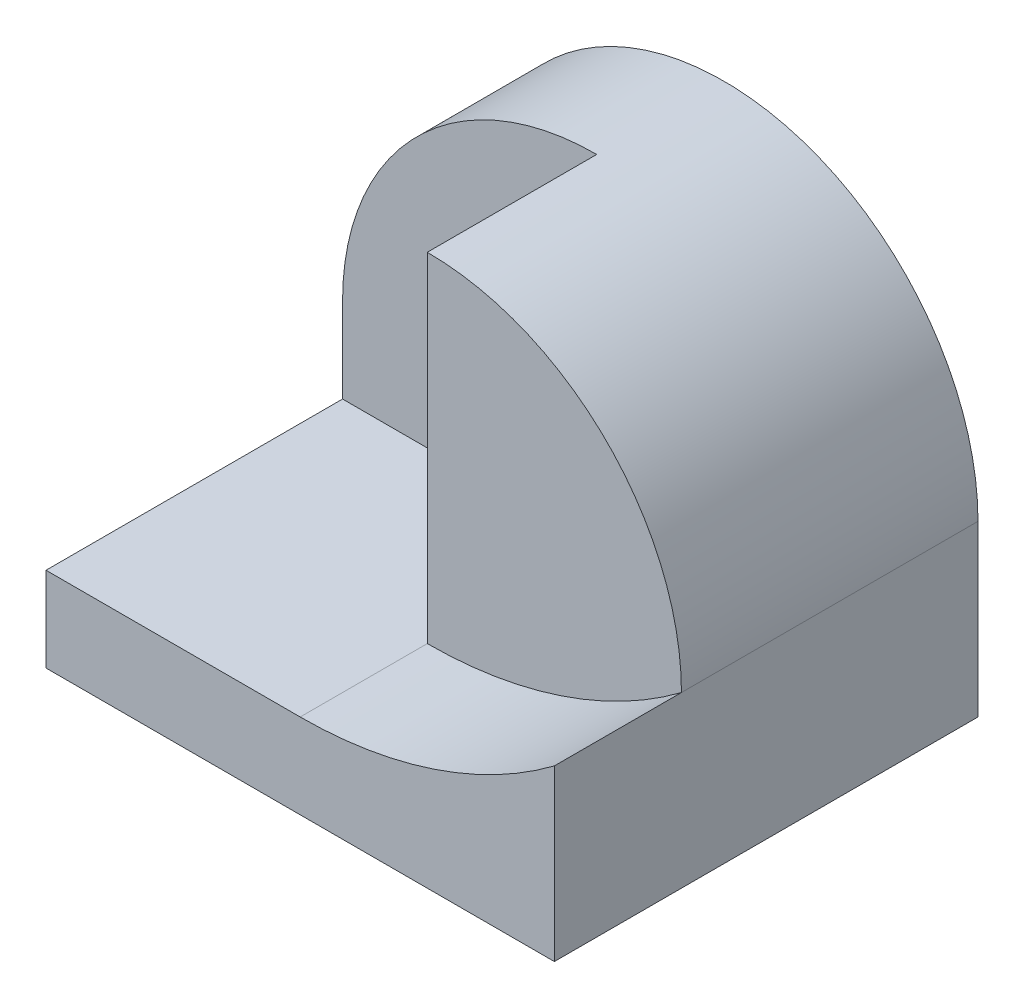
ISO-10303-21;
HEADER;
FILE_DESCRIPTION(('STEP AP214'),'2;1');
FILE_NAME('part.step','',(''),(''),'','','');
FILE_SCHEMA(('AUTOMOTIVE_DESIGN { 1 0 10303 214 1 1 1 1 }'));
ENDSEC;
DATA;
#1=APPLICATION_CONTEXT('core data for automotive mechanical design processes');
#2=APPLICATION_PROTOCOL_DEFINITION('international standard','automotive_design',2000,#1);
#3=PRODUCT_CONTEXT('',#1,'mechanical');
#4=PRODUCT('Part','Part','',(#3));
#5=PRODUCT_RELATED_PRODUCT_CATEGORY('part','',(#4));
#6=PRODUCT_DEFINITION_FORMATION('','',#4);
#7=PRODUCT_DEFINITION_CONTEXT('part definition',#1,'design');
#8=PRODUCT_DEFINITION('design','',#6,#7);
#9=PRODUCT_DEFINITION_SHAPE('','',#8);
#10=(LENGTH_UNIT() NAMED_UNIT(*) SI_UNIT(.MILLI.,.METRE.));
#11=(NAMED_UNIT(*) PLANE_ANGLE_UNIT() SI_UNIT($,.RADIAN.));
#12=(NAMED_UNIT(*) SI_UNIT($,.STERADIAN.) SOLID_ANGLE_UNIT());
#13=UNCERTAINTY_MEASURE_WITH_UNIT(LENGTH_MEASURE(1.E-05),#10,'distance_accuracy_value','');
#14=(GEOMETRIC_REPRESENTATION_CONTEXT(3) GLOBAL_UNCERTAINTY_ASSIGNED_CONTEXT((#13)) GLOBAL_UNIT_ASSIGNED_CONTEXT((#10,
#11,#12)) REPRESENTATION_CONTEXT('',''));
#15=CARTESIAN_POINT('',(0.,0.,0.));
#16=DIRECTION('',(0.,0.,1.));
#17=DIRECTION('',(1.,0.,0.));
#18=AXIS2_PLACEMENT_3D('',#15,#16,#17);
#19=CARTESIAN_POINT('',(30.,20.,15.));
#20=DIRECTION('',(0.,0.,-1.));
#21=DIRECTION('',(-1.,0.,0.));
#22=AXIS2_PLACEMENT_3D('',#19,#20,#21);
#23=CYLINDRICAL_SURFACE('',#22,30.);
#24=CARTESIAN_POINT('',(30.,20.,0.));
#25=DIRECTION('',(0.,0.,-1.));
#26=DIRECTION('',(-1.,0.,0.));
#27=AXIS2_PLACEMENT_3D('',#24,#25,#26);
#28=CIRCLE('',#27,30.);
#29=CARTESIAN_POINT('',(0.,20.,0.));
#30=VERTEX_POINT('',#29);
#31=CARTESIAN_POINT('',(60.,20.,0.));
#32=VERTEX_POINT('',#31);
#33=EDGE_CURVE('E163',#30,#32,#28,.T.);
#34=ORIENTED_EDGE('',*,*,#33,.F.);
#35=DIRECTION('',(0.,0.,-1.));
#36=VECTOR('',#35,1.);
#37=CARTESIAN_POINT('',(0.,20.,15.));
#38=LINE('',#37,#36);
#39=CARTESIAN_POINT('',(0.,20.,15.));
#40=VERTEX_POINT('',#39);
#41=EDGE_CURVE('E11',#40,#30,#38,.T.);
#42=ORIENTED_EDGE('',*,*,#41,.F.);
#43=CARTESIAN_POINT('',(30.,20.,15.));
#44=DIRECTION('',(0.,0.,-1.));
#45=DIRECTION('',(-1.,0.,0.));
#46=AXIS2_PLACEMENT_3D('',#43,#44,#45);
#47=CIRCLE('',#46,30.);
#48=CARTESIAN_POINT('',(30.,50.,15.));
#49=VERTEX_POINT('',#48);
#50=EDGE_CURVE('E51',#40,#49,#47,.T.);
#51=ORIENTED_EDGE('',*,*,#50,.T.);
#52=DIRECTION('',(0.,0.,-1.));
#53=VECTOR('',#52,1.);
#54=CARTESIAN_POINT('',(30.,50.,35.));
#55=LINE('',#54,#53);
#56=CARTESIAN_POINT('',(30.,50.,35.));
#57=VERTEX_POINT('',#56);
#58=EDGE_CURVE('E159',#57,#49,#55,.T.);
#59=ORIENTED_EDGE('',*,*,#58,.F.);
#60=CARTESIAN_POINT('',(30.,20.,35.));
#61=DIRECTION('',(0.,0.,-1.));
#62=DIRECTION('',(1.,0.,0.));
#63=AXIS2_PLACEMENT_3D('',#60,#61,#62);
#64=CIRCLE('',#63,30.);
#65=CARTESIAN_POINT('',(60.,20.,35.));
#66=VERTEX_POINT('',#65);
#67=EDGE_CURVE('E156',#57,#66,#64,.T.);
#68=ORIENTED_EDGE('',*,*,#67,.T.);
#69=DIRECTION('',(0.,0.,-1.));
#70=VECTOR('',#69,1.);
#71=CARTESIAN_POINT('',(60.,20.,35.));
#72=LINE('',#71,#70);
#73=EDGE_CURVE('E160',#66,#32,#72,.T.);
#74=ORIENTED_EDGE('',*,*,#73,.T.);
#75=EDGE_LOOP('',(#34,#42,#51,#59,#68,#74));
#76=FACE_BOUND('',#75,.T.);
#77=ADVANCED_FACE('F35',(#76),#23,.T.);
#78=CARTESIAN_POINT('',(30.,20.,15.));
#79=DIRECTION('',(0.,0.,-1.));
#80=DIRECTION('',(-1.,0.,0.));
#81=AXIS2_PLACEMENT_3D('',#78,#79,#80);
#82=PLANE('',#81);
#83=ORIENTED_EDGE('',*,*,#50,.F.);
#84=DIRECTION('',(0.,-1.,0.));
#85=VECTOR('',#84,1.);
#86=CARTESIAN_POINT('',(0.,20.,15.));
#87=LINE('',#86,#85);
#88=CARTESIAN_POINT('',(0.,10.,15.));
#89=VERTEX_POINT('',#88);
#90=EDGE_CURVE('E102',#40,#89,#87,.T.);
#91=ORIENTED_EDGE('',*,*,#90,.T.);
#92=DIRECTION('',(1.,0.,0.));
#93=VECTOR('',#92,1.);
#94=CARTESIAN_POINT('',(0.,10.,15.));
#95=LINE('',#94,#93);
#96=CARTESIAN_POINT('',(30.,10.,15.));
#97=VERTEX_POINT('',#96);
#98=EDGE_CURVE('E113',#89,#97,#95,.T.);
#99=ORIENTED_EDGE('',*,*,#98,.T.);
#100=DIRECTION('',(0.,-1.,0.));
#101=VECTOR('',#100,1.);
#102=CARTESIAN_POINT('',(30.,50.,15.));
#103=LINE('',#102,#101);
#104=EDGE_CURVE('E44',#49,#97,#103,.T.);
#105=ORIENTED_EDGE('',*,*,#104,.F.);
#106=EDGE_LOOP('',(#83,#91,#99,#105));
#107=FACE_BOUND('',#106,.T.);
#108=ADVANCED_FACE('F120',(#107),#82,.F.);
#109=CARTESIAN_POINT('',(30.,20.,0.));
#110=DIRECTION('',(0.,0.,-1.));
#111=DIRECTION('',(-1.,0.,0.));
#112=AXIS2_PLACEMENT_3D('',#109,#110,#111);
#113=PLANE('',#112);
#114=DIRECTION('',(1.,0.,0.));
#115=VECTOR('',#114,1.);
#116=CARTESIAN_POINT('',(0.,0.,0.));
#117=LINE('',#116,#115);
#118=CARTESIAN_POINT('',(0.,0.,0.));
#119=VERTEX_POINT('',#118);
#120=CARTESIAN_POINT('',(60.,0.,0.));
#121=VERTEX_POINT('',#120);
#122=EDGE_CURVE('E130',#119,#121,#117,.T.);
#123=ORIENTED_EDGE('',*,*,#122,.F.);
#124=DIRECTION('',(0.,1.,0.));
#125=VECTOR('',#124,1.);
#126=CARTESIAN_POINT('',(0.,20.,0.));
#127=LINE('',#126,#125);
#128=EDGE_CURVE('E147',#119,#30,#127,.T.);
#129=ORIENTED_EDGE('',*,*,#128,.T.);
#130=ORIENTED_EDGE('',*,*,#33,.T.);
#131=DIRECTION('',(0.,1.,0.));
#132=VECTOR('',#131,1.);
#133=CARTESIAN_POINT('',(60.,0.,0.));
#134=LINE('',#133,#132);
#135=EDGE_CURVE('E134',#121,#32,#134,.T.);
#136=ORIENTED_EDGE('',*,*,#135,.F.);
#137=EDGE_LOOP('',(#123,#129,#130,#136));
#138=FACE_BOUND('',#137,.T.);
#139=ADVANCED_FACE('F175',(#138),#113,.T.);
#140=CARTESIAN_POINT('',(30.,20.,35.));
#141=DIRECTION('',(-1.,0.,0.));
#142=DIRECTION('',(0.,0.,1.));
#143=AXIS2_PLACEMENT_3D('',#140,#141,#142);
#144=PLANE('',#143);
#145=ORIENTED_EDGE('',*,*,#58,.T.);
#146=ORIENTED_EDGE('',*,*,#104,.T.);
#147=DIRECTION('',(0.,0.,1.));
#148=VECTOR('',#147,1.);
#149=CARTESIAN_POINT('',(30.,10.,15.));
#150=LINE('',#149,#148);
#151=CARTESIAN_POINT('',(30.,10.,35.));
#152=VERTEX_POINT('',#151);
#153=EDGE_CURVE('E117',#97,#152,#150,.T.);
#154=ORIENTED_EDGE('',*,*,#153,.T.);
#155=DIRECTION('',(0.,1.,0.));
#156=VECTOR('',#155,1.);
#157=CARTESIAN_POINT('',(30.,20.,35.));
#158=LINE('',#157,#156);
#159=EDGE_CURVE('E151',#152,#57,#158,.T.);
#160=ORIENTED_EDGE('',*,*,#159,.T.);
#161=EDGE_LOOP('',(#145,#146,#154,#160));
#162=FACE_BOUND('',#161,.T.);
#163=ADVANCED_FACE('F193',(#162),#144,.T.);
#164=CARTESIAN_POINT('',(30.,20.,35.));
#165=DIRECTION('',(0.,0.,1.));
#166=DIRECTION('',(1.,0.,0.));
#167=AXIS2_PLACEMENT_3D('',#164,#165,#166);
#168=PLANE('',#167);
#169=ORIENTED_EDGE('',*,*,#159,.F.);
#170=CARTESIAN_POINT('',(29.9999999999999,60.0000000000002,35.));
#171=DIRECTION('',(0.,0.,-1.));
#172=DIRECTION('',(-1.,0.,0.));
#173=AXIS2_PLACEMENT_3D('',#170,#171,#172);
#174=CIRCLE('',#173,50.0000000000002);
#175=EDGE_CURVE('E148',#66,#152,#174,.T.);
#176=ORIENTED_EDGE('',*,*,#175,.F.);
#177=ORIENTED_EDGE('',*,*,#67,.F.);
#178=EDGE_LOOP('',(#169,#176,#177));
#179=FACE_BOUND('',#178,.T.);
#180=ADVANCED_FACE('F191',(#179),#168,.T.);
#181=CARTESIAN_POINT('',(0.,20.,35.));
#182=DIRECTION('',(-1.,0.,0.));
#183=DIRECTION('',(0.,0.,1.));
#184=AXIS2_PLACEMENT_3D('',#181,#182,#183);
#185=PLANE('',#184);
#186=DIRECTION('',(0.,0.,-1.));
#187=VECTOR('',#186,1.);
#188=CARTESIAN_POINT('',(0.,10.,50.));
#189=LINE('',#188,#187);
#190=CARTESIAN_POINT('',(0.,10.,50.));
#191=VERTEX_POINT('',#190);
#192=EDGE_CURVE('E98',#191,#89,#189,.T.);
#193=ORIENTED_EDGE('',*,*,#192,.T.);
#194=ORIENTED_EDGE('',*,*,#90,.F.);
#195=ORIENTED_EDGE('',*,*,#41,.T.);
#196=ORIENTED_EDGE('',*,*,#128,.F.);
#197=DIRECTION('',(0.,0.,-1.));
#198=VECTOR('',#197,1.);
#199=CARTESIAN_POINT('',(0.,0.,50.));
#200=LINE('',#199,#198);
#201=CARTESIAN_POINT('',(0.,0.,50.));
#202=VERTEX_POINT('',#201);
#203=EDGE_CURVE('E144',#202,#119,#200,.T.);
#204=ORIENTED_EDGE('',*,*,#203,.F.);
#205=DIRECTION('',(0.,-1.,0.));
#206=VECTOR('',#205,1.);
#207=CARTESIAN_POINT('',(0.,0.,50.));
#208=LINE('',#207,#206);
#209=EDGE_CURVE('E105',#191,#202,#208,.T.);
#210=ORIENTED_EDGE('',*,*,#209,.F.);
#211=EDGE_LOOP('',(#193,#194,#195,#196,#204,#210));
#212=FACE_BOUND('',#211,.T.);
#213=ADVANCED_FACE('F100',(#212),#185,.T.);
#214=CARTESIAN_POINT('',(0.,10.,50.));
#215=DIRECTION('',(0.,-1.,0.));
#216=DIRECTION('',(0.,0.,-1.));
#217=AXIS2_PLACEMENT_3D('',#214,#215,#216);
#218=PLANE('',#217);
#219=DIRECTION('',(0.,0.,1.));
#220=VECTOR('',#219,1.);
#221=CARTESIAN_POINT('',(30.,10.,0.));
#222=LINE('',#221,#220);
#223=CARTESIAN_POINT('',(30.,10.,50.));
#224=VERTEX_POINT('',#223);
#225=EDGE_CURVE('E127',#152,#224,#222,.T.);
#226=ORIENTED_EDGE('',*,*,#225,.F.);
#227=ORIENTED_EDGE('',*,*,#153,.F.);
#228=ORIENTED_EDGE('',*,*,#98,.F.);
#229=ORIENTED_EDGE('',*,*,#192,.F.);
#230=DIRECTION('',(-1.,0.,0.));
#231=VECTOR('',#230,1.);
#232=CARTESIAN_POINT('',(0.,10.,50.));
#233=LINE('',#232,#231);
#234=EDGE_CURVE('E109',#224,#191,#233,.T.);
#235=ORIENTED_EDGE('',*,*,#234,.F.);
#236=EDGE_LOOP('',(#226,#227,#228,#229,#235));
#237=FACE_BOUND('',#236,.T.);
#238=ADVANCED_FACE('F115',(#237),#218,.F.);
#239=CARTESIAN_POINT('',(0.,0.,50.));
#240=DIRECTION('',(0.,1.,0.));
#241=DIRECTION('',(0.,0.,1.));
#242=AXIS2_PLACEMENT_3D('',#239,#240,#241);
#243=PLANE('',#242);
#244=ORIENTED_EDGE('',*,*,#122,.T.);
#245=DIRECTION('',(0.,0.,-1.));
#246=VECTOR('',#245,1.);
#247=CARTESIAN_POINT('',(60.,0.,50.));
#248=LINE('',#247,#246);
#249=CARTESIAN_POINT('',(60.,0.,50.));
#250=VERTEX_POINT('',#249);
#251=EDGE_CURVE('E108',#250,#121,#248,.T.);
#252=ORIENTED_EDGE('',*,*,#251,.F.);
#253=DIRECTION('',(1.,0.,0.));
#254=VECTOR('',#253,1.);
#255=CARTESIAN_POINT('',(0.,0.,50.));
#256=LINE('',#255,#254);
#257=EDGE_CURVE('E133',#202,#250,#256,.T.);
#258=ORIENTED_EDGE('',*,*,#257,.F.);
#259=ORIENTED_EDGE('',*,*,#203,.T.);
#260=EDGE_LOOP('',(#244,#252,#258,#259));
#261=FACE_BOUND('',#260,.T.);
#262=ADVANCED_FACE('F184',(#261),#243,.F.);
#263=CARTESIAN_POINT('',(60.,0.,50.));
#264=DIRECTION('',(-1.,0.,0.));
#265=DIRECTION('',(0.,0.,1.));
#266=AXIS2_PLACEMENT_3D('',#263,#264,#265);
#267=PLANE('',#266);
#268=ORIENTED_EDGE('',*,*,#135,.T.);
#269=ORIENTED_EDGE('',*,*,#73,.F.);
#270=DIRECTION('',(0.,0.,1.));
#271=VECTOR('',#270,1.);
#272=CARTESIAN_POINT('',(60.,20.,0.));
#273=LINE('',#272,#271);
#274=CARTESIAN_POINT('',(60.,20.,50.));
#275=VERTEX_POINT('',#274);
#276=EDGE_CURVE('E128',#66,#275,#273,.T.);
#277=ORIENTED_EDGE('',*,*,#276,.T.);
#278=DIRECTION('',(0.,1.,0.));
#279=VECTOR('',#278,1.);
#280=CARTESIAN_POINT('',(60.,0.,50.));
#281=LINE('',#280,#279);
#282=EDGE_CURVE('E136',#250,#275,#281,.T.);
#283=ORIENTED_EDGE('',*,*,#282,.F.);
#284=ORIENTED_EDGE('',*,*,#251,.T.);
#285=EDGE_LOOP('',(#268,#269,#277,#283,#284));
#286=FACE_BOUND('',#285,.T.);
#287=ADVANCED_FACE('F180',(#286),#267,.F.);
#288=CARTESIAN_POINT('',(0.,0.,50.));
#289=DIRECTION('',(0.,0.,-1.));
#290=DIRECTION('',(-1.,0.,0.));
#291=AXIS2_PLACEMENT_3D('',#288,#289,#290);
#292=PLANE('',#291);
#293=ORIENTED_EDGE('',*,*,#209,.T.);
#294=ORIENTED_EDGE('',*,*,#257,.T.);
#295=ORIENTED_EDGE('',*,*,#282,.T.);
#296=CARTESIAN_POINT('',(30.,60.,50.));
#297=DIRECTION('',(0.,0.,1.));
#298=DIRECTION('',(1.,0.,0.));
#299=AXIS2_PLACEMENT_3D('',#296,#297,#298);
#300=CIRCLE('',#299,50.);
#301=EDGE_CURVE('E124',#224,#275,#300,.T.);
#302=ORIENTED_EDGE('',*,*,#301,.F.);
#303=ORIENTED_EDGE('',*,*,#234,.T.);
#304=EDGE_LOOP('',(#293,#294,#295,#302,#303));
#305=FACE_BOUND('',#304,.T.);
#306=ADVANCED_FACE('F186',(#305),#292,.F.);
#307=CARTESIAN_POINT('',(30.,60.,0.));
#308=DIRECTION('',(0.,0.,1.));
#309=DIRECTION('',(1.,0.,0.));
#310=AXIS2_PLACEMENT_3D('',#307,#308,#309);
#311=CYLINDRICAL_SURFACE('',#310,50.);
#312=ORIENTED_EDGE('',*,*,#175,.T.);
#313=ORIENTED_EDGE('',*,*,#225,.T.);
#314=ORIENTED_EDGE('',*,*,#301,.T.);
#315=ORIENTED_EDGE('',*,*,#276,.F.);
#316=EDGE_LOOP('',(#312,#313,#314,#315));
#317=FACE_BOUND('',#316,.T.);
#318=ADVANCED_FACE('F189',(#317),#311,.F.);
#319=CLOSED_SHELL('',(#77,#108,#139,#163,#180,#213,#238,#262,#287,#306,#318));
#320=MANIFOLD_SOLID_BREP('B2',#319);
#321=ADVANCED_BREP_SHAPE_REPRESENTATION('',(#18,#320),#14);
#322=SHAPE_DEFINITION_REPRESENTATION(#9,#321);
ENDSEC;
END-ISO-10303-21;
